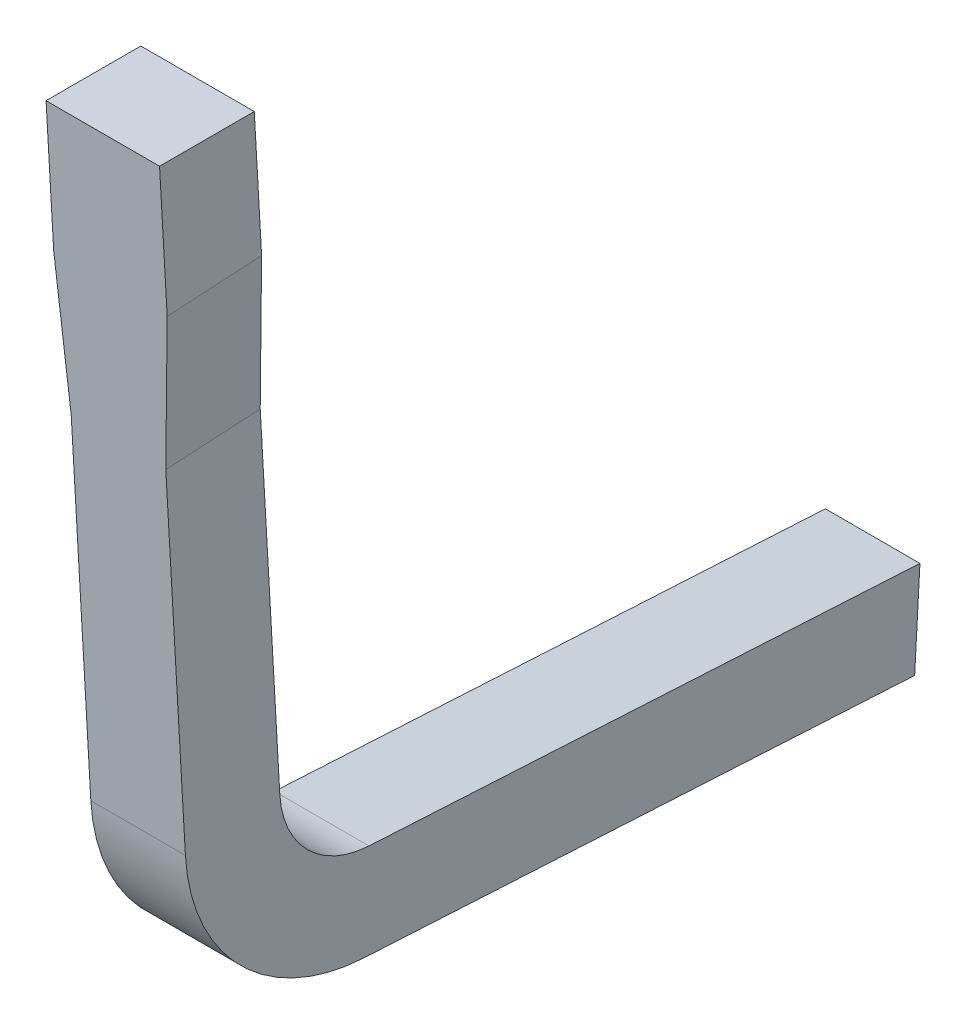
ISO-10303-21;
HEADER;
FILE_DESCRIPTION(('STEP AP214'),'2;1');
FILE_NAME('part.step','',(''),(''),'','','');
FILE_SCHEMA(('AUTOMOTIVE_DESIGN { 1 0 10303 214 1 1 1 1 }'));
ENDSEC;
DATA;
#1=APPLICATION_CONTEXT('core data for automotive mechanical design processes');
#2=APPLICATION_PROTOCOL_DEFINITION('international standard','automotive_design',2000,#1);
#3=PRODUCT_CONTEXT('',#1,'mechanical');
#4=PRODUCT('Part','Part','',(#3));
#5=PRODUCT_RELATED_PRODUCT_CATEGORY('part','',(#4));
#6=PRODUCT_DEFINITION_FORMATION('','',#4);
#7=PRODUCT_DEFINITION_CONTEXT('part definition',#1,'design');
#8=PRODUCT_DEFINITION('design','',#6,#7);
#9=PRODUCT_DEFINITION_SHAPE('','',#8);
#10=(LENGTH_UNIT() NAMED_UNIT(*) SI_UNIT(.MILLI.,.METRE.));
#11=(NAMED_UNIT(*) PLANE_ANGLE_UNIT() SI_UNIT($,.RADIAN.));
#12=(NAMED_UNIT(*) SI_UNIT($,.STERADIAN.) SOLID_ANGLE_UNIT());
#13=UNCERTAINTY_MEASURE_WITH_UNIT(LENGTH_MEASURE(1.E-05),#10,'distance_accuracy_value','');
#14=(GEOMETRIC_REPRESENTATION_CONTEXT(3) GLOBAL_UNCERTAINTY_ASSIGNED_CONTEXT((#13)) GLOBAL_UNIT_ASSIGNED_CONTEXT((#10,
#11,#12)) REPRESENTATION_CONTEXT('',''));
#15=CARTESIAN_POINT('',(0.,0.,0.));
#16=DIRECTION('',(0.,0.,1.));
#17=DIRECTION('',(1.,0.,0.));
#18=AXIS2_PLACEMENT_3D('',#15,#16,#17);
#19=CARTESIAN_POINT('',(-4.12,-1.879082198882,-10.32387202233));
#20=DIRECTION('',(1.,0.,0.));
#21=DIRECTION('',(0.,0.,-1.));
#22=AXIS2_PLACEMENT_3D('',#19,#20,#21);
#23=PLANE('',#22);
#24=DIRECTION('',(1.82145964980951E-13,-0.0569406083160486,0.998377567418559));
#25=VECTOR('',#24,1.);
#26=CARTESIAN_POINT('',(-4.12000000000001,-2.014836222708,-10.43177700759));
#27=LINE('',#26,#25);
#28=CARTESIAN_POINT('',(-4.12,-2.01483622270797,-10.4317770075908));
#29=VERTEX_POINT('',#28);
#30=CARTESIAN_POINT('',(-4.11999999999999,-2.02622434437119,-10.2321014941066));
#31=VERTEX_POINT('',#30);
#32=EDGE_CURVE('E183',#29,#31,#27,.T.);
#33=ORIENTED_EDGE('',*,*,#32,.T.);
#34=DIRECTION('',(0.,-0.998377567418999,-0.0569406083083299));
#35=VECTOR('',#34,1.);
#36=CARTESIAN_POINT('',(-4.12,-2.398052209196,-10.25330800505));
#37=LINE('',#36,#35);
#38=CARTESIAN_POINT('',(-4.12,-1.74332817505504,-10.2159670370689));
#39=VERTEX_POINT('',#38);
#40=EDGE_CURVE('E180',#39,#31,#37,.T.);
#41=ORIENTED_EDGE('',*,*,#40,.F.);
#42=DIRECTION('',(0.,0.,1.));
#43=VECTOR('',#42,1.);
#44=CARTESIAN_POINT('',(-4.12,-1.743328175055,-10.31612954398));
#45=LINE('',#44,#43);
#46=CARTESIAN_POINT('',(-4.12,-1.74332817505473,-10.4162920508947));
#47=VERTEX_POINT('',#46);
#48=EDGE_CURVE('E175',#47,#39,#45,.T.);
#49=ORIENTED_EDGE('',*,*,#48,.F.);
#50=DIRECTION('',(0.,-0.998377567418624,-0.0569406083148914));
#51=VECTOR('',#50,1.);
#52=CARTESIAN_POINT('',(-4.12,-2.392358148368,-10.45330826871));
#53=LINE('',#52,#51);
#54=EDGE_CURVE('E205',#47,#29,#53,.T.);
#55=ORIENTED_EDGE('',*,*,#54,.T.);
#56=EDGE_LOOP('',(#33,#41,#49,#55));
#57=FACE_BOUND('',#56,.T.);
#58=ADVANCED_FACE('F17',(#57),#23,.F.);
#59=CARTESIAN_POINT('',(-4.11,-2.170286918652,-10.3404803421));
#60=DIRECTION('',(0.997785157856611,0.0664110879138007,0.00378763292362404));
#61=DIRECTION('',(-0.0664115642910779,0.997792315127959,0.));
#62=AXIS2_PLACEMENT_3D('',#59,#60,#61);
#63=PLANE('',#62);
#64=DIRECTION('',(0.0665190105237422,-0.996166318707665,-0.0568144938493813));
#65=VECTOR('',#64,1.);
#66=CARTESIAN_POINT('',(-4.12,-2.02622434437119,-10.2321014941066));
#67=LINE('',#66,#65);
#68=CARTESIAN_POINT('',(-4.1,-2.32573761459705,-10.2491836765991));
#69=VERTEX_POINT('',#68);
#70=EDGE_CURVE('E161',#31,#69,#67,.T.);
#71=ORIENTED_EDGE('',*,*,#70,.F.);
#72=ORIENTED_EDGE('',*,*,#32,.F.);
#73=DIRECTION('',(0.0665190105237422,-0.996166318707292,-0.0568144938559241));
#74=VECTOR('',#73,1.);
#75=CARTESIAN_POINT('',(-4.12,-2.01483622270793,-10.4317770075911));
#76=LINE('',#75,#74);
#77=CARTESIAN_POINT('',(-4.1,-2.31434949293378,-10.4488591900838));
#78=VERTEX_POINT('',#77);
#79=EDGE_CURVE('E115',#29,#78,#76,.T.);
#80=ORIENTED_EDGE('',*,*,#79,.T.);
#81=DIRECTION('',(0.,-0.0569406083160594,0.998377567418558));
#82=VECTOR('',#81,1.);
#83=CARTESIAN_POINT('',(-4.1,-2.314349492934,-10.44885919008));
#84=LINE('',#83,#82);
#85=EDGE_CURVE('E110',#78,#69,#84,.T.);
#86=ORIENTED_EDGE('',*,*,#85,.T.);
#87=EDGE_LOOP('',(#71,#72,#80,#86));
#88=FACE_BOUND('',#87,.T.);
#89=ADVANCED_FACE('F288',(#88),#63,.F.);
#90=CARTESIAN_POINT('',(-3.88,-1.879082198882,-10.32387202233));
#91=DIRECTION('',(1.,0.,0.));
#92=DIRECTION('',(0.,0.,-1.));
#93=AXIS2_PLACEMENT_3D('',#90,#91,#92);
#94=PLANE('',#93);
#95=DIRECTION('',(0.,-0.998377567418624,-0.0569406083148914));
#96=VECTOR('',#95,1.);
#97=CARTESIAN_POINT('',(-3.88,-2.392358148368,-10.45330826871));
#98=LINE('',#97,#96);
#99=CARTESIAN_POINT('',(-3.87999999999998,-2.01483622270898,-10.4317770075904));
#100=VERTEX_POINT('',#99);
#101=CARTESIAN_POINT('',(-3.88,-1.74332817505473,-10.4162920508947));
#102=VERTEX_POINT('',#101);
#103=EDGE_CURVE('E128',#100,#102,#98,.F.);
#104=ORIENTED_EDGE('',*,*,#103,.T.);
#105=DIRECTION('',(0.,0.,1.));
#106=VECTOR('',#105,1.);
#107=CARTESIAN_POINT('',(-3.88,-1.743328175055,-10.31612954398));
#108=LINE('',#107,#106);
#109=CARTESIAN_POINT('',(-3.88,-1.74332817505504,-10.2159670370692));
#110=VERTEX_POINT('',#109);
#111=EDGE_CURVE('E185',#110,#102,#108,.F.);
#112=ORIENTED_EDGE('',*,*,#111,.F.);
#113=DIRECTION('',(0.,-0.998377567418999,-0.0569406083083299));
#114=VECTOR('',#113,1.);
#115=CARTESIAN_POINT('',(-3.88,-2.398052209196,-10.25330800505));
#116=LINE('',#115,#114);
#117=CARTESIAN_POINT('',(-3.87999999999999,-2.02622434437119,-10.2321014941066));
#118=VERTEX_POINT('',#117);
#119=EDGE_CURVE('E168',#118,#110,#116,.F.);
#120=ORIENTED_EDGE('',*,*,#119,.F.);
#121=DIRECTION('',(0.,-0.0569406083110731,0.998377567418842));
#122=VECTOR('',#121,1.);
#123=CARTESIAN_POINT('',(-3.87999999999997,-2.014836222709,-10.43177700759));
#124=LINE('',#123,#122);
#125=EDGE_CURVE('E131',#100,#118,#124,.T.);
#126=ORIENTED_EDGE('',*,*,#125,.F.);
#127=EDGE_LOOP('',(#104,#112,#120,#126));
#128=FACE_BOUND('',#127,.T.);
#129=ADVANCED_FACE('F251',(#128),#94,.T.);
#130=CARTESIAN_POINT('',(-4.,-1.743328175055,-10.31612954398));
#131=DIRECTION('',(0.,1.,0.));
#132=DIRECTION('',(0.,0.,1.));
#133=AXIS2_PLACEMENT_3D('',#130,#131,#132);
#134=PLANE('',#133);
#135=DIRECTION('',(1.,0.,0.));
#136=VECTOR('',#135,1.);
#137=CARTESIAN_POINT('',(-4.,-1.74332817505459,-10.4162920508971));
#138=LINE('',#137,#136);
#139=EDGE_CURVE('E138',#102,#47,#138,.F.);
#140=ORIENTED_EDGE('',*,*,#139,.T.);
#141=ORIENTED_EDGE('',*,*,#48,.T.);
#142=DIRECTION('',(1.,0.,0.));
#143=VECTOR('',#142,1.);
#144=CARTESIAN_POINT('',(-4.,-1.74332817505506,-10.2159670370689));
#145=LINE('',#144,#143);
#146=EDGE_CURVE('E171',#110,#39,#145,.F.);
#147=ORIENTED_EDGE('',*,*,#146,.F.);
#148=ORIENTED_EDGE('',*,*,#111,.T.);
#149=EDGE_LOOP('',(#140,#141,#147,#148));
#150=FACE_BOUND('',#149,.T.);
#151=ADVANCED_FACE('F291',(#150),#134,.T.);
#152=CARTESIAN_POINT('',(-4.1,-2.898875732105,-11.04167004462));
#153=DIRECTION('',(1.,0.,0.));
#154=DIRECTION('',(0.,0.,-1.));
#155=AXIS2_PLACEMENT_3D('',#152,#153,#154);
#156=PLANE('',#155);
#157=CARTESIAN_POINT('',(-4.1,-3.03,-10.69));
#158=DIRECTION('',(-1.,0.,0.));
#159=DIRECTION('',(0.,0.,1.));
#160=AXIS2_PLACEMENT_3D('',#157,#158,#159);
#161=CIRCLE('',#160,0.4);
#162=CARTESIAN_POINT('',(-4.1,-3.05277624332116,-10.2906489730313));
#163=VERTEX_POINT('',#162);
#164=CARTESIAN_POINT('',(-4.1,-3.42937693582933,-10.6676826720305));
#165=VERTEX_POINT('',#164);
#166=EDGE_CURVE('E155',#163,#165,#161,.F.);
#167=ORIENTED_EDGE('',*,*,#166,.F.);
#168=DIRECTION('',(0.,-0.998377567418999,-0.0569406083083299));
#169=VECTOR('',#168,1.);
#170=CARTESIAN_POINT('',(-4.1,-2.398052209196,-10.25330800505));
#171=LINE('',#170,#169);
#172=EDGE_CURVE('E158',#69,#163,#171,.T.);
#173=ORIENTED_EDGE('',*,*,#172,.F.);
#174=ORIENTED_EDGE('',*,*,#85,.F.);
#175=DIRECTION('',(0.,-0.998377567418624,-0.0569406083148914));
#176=VECTOR('',#175,1.);
#177=CARTESIAN_POINT('',(-4.1,-2.392358148368,-10.45330826871));
#178=LINE('',#177,#176);
#179=CARTESIAN_POINT('',(-4.1,-3.0413881216286,-10.4903244865199));
#180=VERTEX_POINT('',#179);
#181=EDGE_CURVE('E104',#78,#180,#178,.T.);
#182=ORIENTED_EDGE('',*,*,#181,.T.);
#183=CARTESIAN_POINT('',(-4.1,-3.03,-10.69));
#184=DIRECTION('',(-1.,0.,0.));
#185=DIRECTION('',(0.,0.,1.));
#186=AXIS2_PLACEMENT_3D('',#183,#184,#185);
#187=CIRCLE('',#186,0.2);
#188=CARTESIAN_POINT('',(-4.1,-3.22968846791482,-10.6788413360177));
#189=VERTEX_POINT('',#188);
#190=EDGE_CURVE('E20',#180,#189,#187,.F.);
#191=ORIENTED_EDGE('',*,*,#190,.T.);
#192=DIRECTION('',(0.,0.0557933199228295,0.998442339572991));
#193=VECTOR('',#192,1.);
#194=CARTESIAN_POINT('',(-4.1,-3.262244863925,-11.26145022621));
#195=LINE('',#194,#193);
#196=CARTESIAN_POINT('',(-4.1,-3.29480125993501,-11.8440591164004));
#197=VERTEX_POINT('',#196);
#198=EDGE_CURVE('E123',#197,#189,#195,.T.);
#199=ORIENTED_EDGE('',*,*,#198,.F.);
#200=DIRECTION('',(0.,-0.998442339574031,0.0557933199042218));
#201=VECTOR('',#200,1.);
#202=CARTESIAN_POINT('',(-4.1,-3.394645493892,-11.83847978441));
#203=LINE('',#202,#201);
#204=CARTESIAN_POINT('',(-4.1,-3.49448972784906,-11.8329004524196));
#205=VERTEX_POINT('',#204);
#206=EDGE_CURVE('E148',#197,#205,#203,.T.);
#207=ORIENTED_EDGE('',*,*,#206,.T.);
#208=DIRECTION('',(0.,0.055793319922371,0.998442339573017));
#209=VECTOR('',#208,1.);
#210=CARTESIAN_POINT('',(-4.1,-3.461933331839,-11.25029156222));
#211=LINE('',#210,#209);
#212=EDGE_CURVE('E153',#205,#165,#211,.T.);
#213=ORIENTED_EDGE('',*,*,#212,.T.);
#214=EDGE_LOOP('',(#167,#173,#174,#182,#191,#199,#207,#213));
#215=FACE_BOUND('',#214,.T.);
#216=ADVANCED_FACE('F107',(#215),#156,.F.);
#217=CARTESIAN_POINT('',(-4.,-3.262244863925,-11.26145022621));
#218=DIRECTION('',(0.,0.998442339572991,-0.0557933199228295));
#219=DIRECTION('',(0.,0.0557933199228295,0.998442339572991));
#220=AXIS2_PLACEMENT_3D('',#217,#218,#219);
#221=PLANE('',#220);
#222=DIRECTION('',(0.,0.055793319922887,0.998442339572988));
#223=VECTOR('',#222,1.);
#224=CARTESIAN_POINT('',(-3.9,-3.294801259935,-11.8440591164));
#225=LINE('',#224,#223);
#226=CARTESIAN_POINT('',(-3.9,-3.29480125993501,-11.8440591164001));
#227=VERTEX_POINT('',#226);
#228=CARTESIAN_POINT('',(-3.9,-3.2296884679148,-10.6788413360177));
#229=VERTEX_POINT('',#228);
#230=EDGE_CURVE('E142',#227,#229,#225,.T.);
#231=ORIENTED_EDGE('',*,*,#230,.F.);
#232=DIRECTION('',(1.,0.,0.));
#233=VECTOR('',#232,1.);
#234=CARTESIAN_POINT('',(-4.,-3.29480125993502,-11.8440591164004));
#235=LINE('',#234,#233);
#236=EDGE_CURVE('E139',#227,#197,#235,.F.);
#237=ORIENTED_EDGE('',*,*,#236,.T.);
#238=ORIENTED_EDGE('',*,*,#198,.T.);
#239=DIRECTION('',(-1.,0.,0.));
#240=VECTOR('',#239,1.);
#241=CARTESIAN_POINT('',(-3.896,-3.22968846791485,-10.67884133602));
#242=LINE('',#241,#240);
#243=EDGE_CURVE('E122',#189,#229,#242,.F.);
#244=ORIENTED_EDGE('',*,*,#243,.T.);
#245=EDGE_LOOP('',(#231,#237,#238,#244));
#246=FACE_BOUND('',#245,.T.);
#247=ADVANCED_FACE('F284',(#246),#221,.T.);
#248=CARTESIAN_POINT('',(-3.896,-3.03,-10.69));
#249=DIRECTION('',(-1.,0.,0.));
#250=DIRECTION('',(0.,0.,1.));
#251=AXIS2_PLACEMENT_3D('',#248,#249,#250);
#252=CYLINDRICAL_SURFACE('',#251,0.2);
#253=ORIENTED_EDGE('',*,*,#190,.F.);
#254=DIRECTION('',(1.,0.,0.));
#255=VECTOR('',#254,1.);
#256=CARTESIAN_POINT('',(-4.,-3.04138812159455,-10.4903244865179));
#257=LINE('',#256,#255);
#258=CARTESIAN_POINT('',(-3.9,-3.04138812162905,-10.4903244865184));
#259=VERTEX_POINT('',#258);
#260=EDGE_CURVE('E114',#180,#259,#257,.T.);
#261=ORIENTED_EDGE('',*,*,#260,.T.);
#262=CARTESIAN_POINT('',(-3.9,-3.03,-10.69));
#263=DIRECTION('',(-1.,0.,0.));
#264=DIRECTION('',(0.,0.,1.));
#265=AXIS2_PLACEMENT_3D('',#262,#263,#264);
#266=CIRCLE('',#265,0.2);
#267=EDGE_CURVE('E223',#229,#259,#266,.T.);
#268=ORIENTED_EDGE('',*,*,#267,.F.);
#269=ORIENTED_EDGE('',*,*,#243,.F.);
#270=EDGE_LOOP('',(#253,#261,#268,#269));
#271=FACE_BOUND('',#270,.T.);
#272=ADVANCED_FACE('F119',(#271),#252,.F.);
#273=CARTESIAN_POINT('',(-4.,-2.392358148368,-10.45330826871));
#274=DIRECTION('',(0.,-0.0569406083148914,0.998377567418624));
#275=DIRECTION('',(0.,-0.998377567418624,-0.0569406083148914));
#276=AXIS2_PLACEMENT_3D('',#273,#274,#275);
#277=PLANE('',#276);
#278=DIRECTION('',(0.0665190105240593,0.996166318708109,0.0568144938412267));
#279=VECTOR('',#278,1.);
#280=CARTESIAN_POINT('',(-3.9,-2.314349492934,-10.44885919008));
#281=LINE('',#280,#279);
#282=CARTESIAN_POINT('',(-3.9,-2.314349492934,-10.44885919008));
#283=VERTEX_POINT('',#282);
#284=EDGE_CURVE('E165',#283,#100,#281,.T.);
#285=ORIENTED_EDGE('',*,*,#284,.F.);
#286=DIRECTION('',(0.,0.998377567418421,0.0569406083184697));
#287=VECTOR('',#286,1.);
#288=CARTESIAN_POINT('',(-3.9,-3.041388121684,-10.49032448652));
#289=LINE('',#288,#287);
#290=EDGE_CURVE('E126',#259,#283,#289,.T.);
#291=ORIENTED_EDGE('',*,*,#290,.F.);
#292=ORIENTED_EDGE('',*,*,#260,.F.);
#293=ORIENTED_EDGE('',*,*,#181,.F.);
#294=ORIENTED_EDGE('',*,*,#79,.F.);
#295=ORIENTED_EDGE('',*,*,#54,.F.);
#296=ORIENTED_EDGE('',*,*,#139,.F.);
#297=ORIENTED_EDGE('',*,*,#103,.F.);
#298=EDGE_LOOP('',(#285,#291,#292,#293,#294,#295,#296,#297));
#299=FACE_BOUND('',#298,.T.);
#300=ADVANCED_FACE('F124',(#299),#277,.F.);
#301=CARTESIAN_POINT('',(-3.89,-2.170286918653,-10.34048034209));
#302=DIRECTION('',(0.99778515785659,-0.0664110879141193,-0.00378763292348296));
#303=DIRECTION('',(0.0664115642913965,0.997792315127938,0.));
#304=AXIS2_PLACEMENT_3D('',#301,#302,#303);
#305=PLANE('',#304);
#306=DIRECTION('',(0.,-0.0569406083160594,0.998377567418558));
#307=VECTOR('',#306,1.);
#308=CARTESIAN_POINT('',(-3.9,-2.314349492934,-10.44885919008));
#309=LINE('',#308,#307);
#310=CARTESIAN_POINT('',(-3.9,-2.32573761459702,-10.2491836765997));
#311=VERTEX_POINT('',#310);
#312=EDGE_CURVE('E238',#283,#311,#309,.T.);
#313=ORIENTED_EDGE('',*,*,#312,.F.);
#314=ORIENTED_EDGE('',*,*,#284,.T.);
#315=ORIENTED_EDGE('',*,*,#125,.T.);
#316=DIRECTION('',(0.0665190105237393,0.996166318707665,0.0568144938493813));
#317=VECTOR('',#316,1.);
#318=CARTESIAN_POINT('',(-3.9,-2.32573761459705,-10.2491836765991));
#319=LINE('',#318,#317);
#320=EDGE_CURVE('E160',#311,#118,#319,.T.);
#321=ORIENTED_EDGE('',*,*,#320,.F.);
#322=EDGE_LOOP('',(#313,#314,#315,#321));
#323=FACE_BOUND('',#322,.T.);
#324=ADVANCED_FACE('F245',(#323),#305,.T.);
#325=CARTESIAN_POINT('',(-4.,-2.398052209196,-10.25330800505));
#326=DIRECTION('',(0.,-0.0569406083083299,0.998377567418999));
#327=DIRECTION('',(0.,-0.998377567418999,-0.0569406083083299));
#328=AXIS2_PLACEMENT_3D('',#325,#326,#327);
#329=PLANE('',#328);
#330=ORIENTED_EDGE('',*,*,#119,.T.);
#331=ORIENTED_EDGE('',*,*,#146,.T.);
#332=ORIENTED_EDGE('',*,*,#40,.T.);
#333=ORIENTED_EDGE('',*,*,#70,.T.);
#334=ORIENTED_EDGE('',*,*,#172,.T.);
#335=DIRECTION('',(-1.,0.,0.));
#336=VECTOR('',#335,1.);
#337=CARTESIAN_POINT('',(-3.896,-3.05277624331888,-10.2906489730321));
#338=LINE('',#337,#336);
#339=CARTESIAN_POINT('',(-3.9,-3.05277624332089,-10.2906489730312));
#340=VERTEX_POINT('',#339);
#341=EDGE_CURVE('E198',#340,#163,#338,.T.);
#342=ORIENTED_EDGE('',*,*,#341,.F.);
#343=DIRECTION('',(0.,-0.998377567419076,-0.0569406083069694));
#344=VECTOR('',#343,1.);
#345=CARTESIAN_POINT('',(-3.9,-2.325737614597,-10.2491836766));
#346=LINE('',#345,#344);
#347=EDGE_CURVE('E222',#311,#340,#346,.T.);
#348=ORIENTED_EDGE('',*,*,#347,.F.);
#349=ORIENTED_EDGE('',*,*,#320,.T.);
#350=EDGE_LOOP('',(#330,#331,#332,#333,#334,#342,#348,#349));
#351=FACE_BOUND('',#350,.T.);
#352=ADVANCED_FACE('F255',(#351),#329,.T.);
#353=CARTESIAN_POINT('',(-3.896,-3.03,-10.69));
#354=DIRECTION('',(-1.,0.,0.));
#355=DIRECTION('',(0.,0.,1.));
#356=AXIS2_PLACEMENT_3D('',#353,#354,#355);
#357=CYLINDRICAL_SURFACE('',#356,0.4);
#358=DIRECTION('',(1.,0.,0.));
#359=VECTOR('',#358,1.);
#360=CARTESIAN_POINT('',(-4.,-3.4293769358293,-10.66768267203));
#361=LINE('',#360,#359);
#362=CARTESIAN_POINT('',(-3.9,-3.42937693582946,-10.6676826720306));
#363=VERTEX_POINT('',#362);
#364=EDGE_CURVE('E150',#165,#363,#361,.T.);
#365=ORIENTED_EDGE('',*,*,#364,.T.);
#366=CARTESIAN_POINT('',(-3.9,-3.03,-10.69));
#367=DIRECTION('',(-1.,0.,0.));
#368=DIRECTION('',(0.,0.,1.));
#369=AXIS2_PLACEMENT_3D('',#366,#367,#368);
#370=CIRCLE('',#369,0.4);
#371=EDGE_CURVE('E219',#340,#363,#370,.F.);
#372=ORIENTED_EDGE('',*,*,#371,.F.);
#373=ORIENTED_EDGE('',*,*,#341,.T.);
#374=ORIENTED_EDGE('',*,*,#166,.T.);
#375=EDGE_LOOP('',(#365,#372,#373,#374));
#376=FACE_BOUND('',#375,.T.);
#377=ADVANCED_FACE('F273',(#376),#357,.T.);
#378=CARTESIAN_POINT('',(-4.,-3.461933331839,-11.25029156222));
#379=DIRECTION('',(0.,0.998442339573017,-0.055793319922371));
#380=DIRECTION('',(0.,0.055793319922371,0.998442339573017));
#381=AXIS2_PLACEMENT_3D('',#378,#379,#380);
#382=PLANE('',#381);
#383=ORIENTED_EDGE('',*,*,#364,.F.);
#384=ORIENTED_EDGE('',*,*,#212,.F.);
#385=DIRECTION('',(1.,0.,0.));
#386=VECTOR('',#385,1.);
#387=CARTESIAN_POINT('',(-4.,-3.49448972784898,-11.8329004524196));
#388=LINE('',#387,#386);
#389=CARTESIAN_POINT('',(-3.9,-3.49448972784899,-11.8329004524199));
#390=VERTEX_POINT('',#389);
#391=EDGE_CURVE('E35',#205,#390,#388,.T.);
#392=ORIENTED_EDGE('',*,*,#391,.T.);
#393=DIRECTION('',(0.,-0.0557933199219327,-0.998442339573042));
#394=VECTOR('',#393,1.);
#395=CARTESIAN_POINT('',(-3.9,-3.429376935829,-10.66768267202));
#396=LINE('',#395,#394);
#397=EDGE_CURVE('E26',#363,#390,#396,.T.);
#398=ORIENTED_EDGE('',*,*,#397,.F.);
#399=EDGE_LOOP('',(#383,#384,#392,#398));
#400=FACE_BOUND('',#399,.T.);
#401=ADVANCED_FACE('F274',(#400),#382,.F.);
#402=CARTESIAN_POINT('',(-4.,-3.394645493892,-11.83847978441));
#403=DIRECTION('',(0.,0.0557933199042218,0.998442339574031));
#404=DIRECTION('',(0.,-0.998442339574031,0.0557933199042218));
#405=AXIS2_PLACEMENT_3D('',#402,#403,#404);
#406=PLANE('',#405);
#407=DIRECTION('',(0.,0.998442339574254,-0.0557933199002383));
#408=VECTOR('',#407,1.);
#409=CARTESIAN_POINT('',(-3.9,-3.494489727849,-11.83290045242));
#410=LINE('',#409,#408);
#411=EDGE_CURVE('E11',#390,#227,#410,.T.);
#412=ORIENTED_EDGE('',*,*,#411,.F.);
#413=ORIENTED_EDGE('',*,*,#391,.F.);
#414=ORIENTED_EDGE('',*,*,#206,.F.);
#415=ORIENTED_EDGE('',*,*,#236,.F.);
#416=EDGE_LOOP('',(#412,#413,#414,#415));
#417=FACE_BOUND('',#416,.T.);
#418=ADVANCED_FACE('F281',(#417),#406,.F.);
#419=CARTESIAN_POINT('',(-3.9,-2.909472777839,-11.05227927458));
#420=DIRECTION('',(1.,0.,0.));
#421=DIRECTION('',(0.,0.,-1.));
#422=AXIS2_PLACEMENT_3D('',#419,#420,#421);
#423=PLANE('',#422);
#424=ORIENTED_EDGE('',*,*,#397,.T.);
#425=ORIENTED_EDGE('',*,*,#411,.T.);
#426=ORIENTED_EDGE('',*,*,#230,.T.);
#427=ORIENTED_EDGE('',*,*,#267,.T.);
#428=ORIENTED_EDGE('',*,*,#290,.T.);
#429=ORIENTED_EDGE('',*,*,#312,.T.);
#430=ORIENTED_EDGE('',*,*,#347,.T.);
#431=ORIENTED_EDGE('',*,*,#371,.T.);
#432=EDGE_LOOP('',(#424,#425,#426,#427,#428,#429,#430,#431));
#433=FACE_BOUND('',#432,.T.);
#434=ADVANCED_FACE('F260',(#433),#423,.T.);
#435=CLOSED_SHELL('',(#58,#89,#129,#151,#216,#247,#272,#300,#324,#352,#377,#401,#418,#434));
#436=MANIFOLD_SOLID_BREP('B1',#435);
#437=ADVANCED_BREP_SHAPE_REPRESENTATION('',(#18,#436),#14);
#438=SHAPE_DEFINITION_REPRESENTATION(#9,#437);
ENDSEC;
END-ISO-10303-21;
